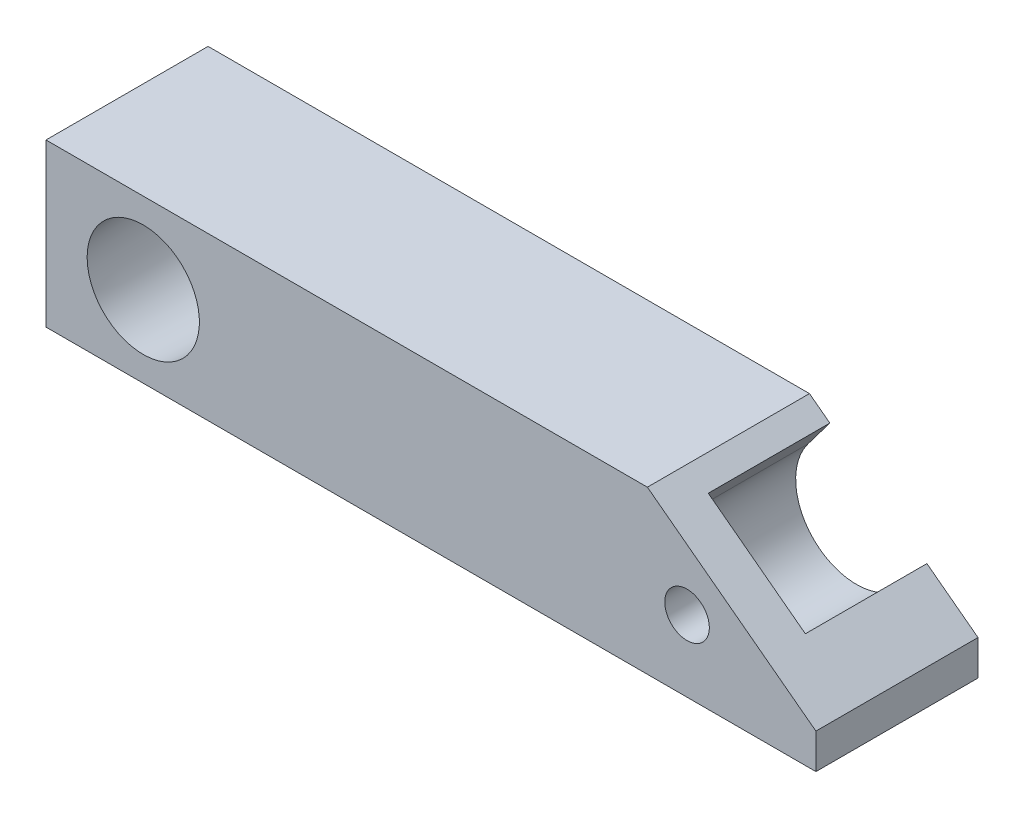
ISO-10303-21;
HEADER;
FILE_DESCRIPTION(('STEP AP214'),'2;1');
FILE_NAME('part.step','',(''),(''),'','','');
FILE_SCHEMA(('AUTOMOTIVE_DESIGN { 1 0 10303 214 1 1 1 1 }'));
ENDSEC;
DATA;
#1=APPLICATION_CONTEXT('core data for automotive mechanical design processes');
#2=APPLICATION_PROTOCOL_DEFINITION('international standard','automotive_design',2000,#1);
#3=PRODUCT_CONTEXT('',#1,'mechanical');
#4=PRODUCT('Part','Part','',(#3));
#5=PRODUCT_RELATED_PRODUCT_CATEGORY('part','',(#4));
#6=PRODUCT_DEFINITION_FORMATION('','',#4);
#7=PRODUCT_DEFINITION_CONTEXT('part definition',#1,'design');
#8=PRODUCT_DEFINITION('design','',#6,#7);
#9=PRODUCT_DEFINITION_SHAPE('','',#8);
#10=(LENGTH_UNIT() NAMED_UNIT(*) SI_UNIT(.MILLI.,.METRE.));
#11=(NAMED_UNIT(*) PLANE_ANGLE_UNIT() SI_UNIT($,.RADIAN.));
#12=(NAMED_UNIT(*) SI_UNIT($,.STERADIAN.) SOLID_ANGLE_UNIT());
#13=UNCERTAINTY_MEASURE_WITH_UNIT(LENGTH_MEASURE(1.E-05),#10,'distance_accuracy_value','');
#14=(GEOMETRIC_REPRESENTATION_CONTEXT(3) GLOBAL_UNCERTAINTY_ASSIGNED_CONTEXT((#13)) GLOBAL_UNIT_ASSIGNED_CONTEXT((#10,
#11,#12)) REPRESENTATION_CONTEXT('',''));
#15=CARTESIAN_POINT('',(0.,0.,0.));
#16=DIRECTION('',(0.,0.,1.));
#17=DIRECTION('',(1.,0.,0.));
#18=AXIS2_PLACEMENT_3D('',#15,#16,#17);
#19=CARTESIAN_POINT('',(-12.,-10.,-20.));
#20=DIRECTION('',(0.,0.,-1.));
#21=DIRECTION('',(0.,-1.,0.));
#22=AXIS2_PLACEMENT_3D('',#19,#20,#21);
#23=PLANE('',#22);
#24=CARTESIAN_POINT('',(0.,0.,-20.));
#25=DIRECTION('',(0.,0.,-1.));
#26=DIRECTION('',(-1.,0.,0.));
#27=AXIS2_PLACEMENT_3D('',#24,#25,#26);
#28=CIRCLE('',#27,7.925);
#29=CARTESIAN_POINT('',(-7.925,0.,-20.));
#30=VERTEX_POINT('',#29);
#31=EDGE_CURVE('E169',#30,#30,#28,.T.);
#32=ORIENTED_EDGE('',*,*,#31,.F.);
#33=EDGE_LOOP('',(#32));
#34=FACE_BOUND('',#33,.T.);
#35=CARTESIAN_POINT('',(68.,0.,-20.));
#36=DIRECTION('',(0.,0.,-1.));
#37=DIRECTION('',(-1.,0.,0.));
#38=AXIS2_PLACEMENT_3D('',#35,#36,#37);
#39=CIRCLE('',#38,7.5);
#40=CARTESIAN_POINT('',(73.9897663253547,-4.51361267364033,-20.));
#41=VERTEX_POINT('',#40);
#42=CARTESIAN_POINT('',(62.0102336746453,4.51361267364033,-20.));
#43=VERTEX_POINT('',#42);
#44=EDGE_CURVE('E138',#41,#43,#39,.T.);
#45=ORIENTED_EDGE('',*,*,#44,.F.);
#46=DIRECTION('',(0.601815023152043,0.798635510047297,0.));
#47=VECTOR('',#46,1.);
#48=CARTESIAN_POINT('',(73.9897663253547,-4.51361267364033,-20.));
#49=LINE('',#48,#47);
#50=CARTESIAN_POINT('',(76.6979339295389,-0.919752878427501,-20.));
#51=VERTEX_POINT('',#50);
#52=EDGE_CURVE('E199',#41,#51,#49,.T.);
#53=ORIENTED_EDGE('',*,*,#52,.T.);
#54=DIRECTION('',(-0.798635510047296,0.601815023152043,0.));
#55=VECTOR('',#54,1.);
#56=CARTESIAN_POINT('',(83.,-5.6687002898388,-20.));
#57=LINE('',#56,#55);
#58=CARTESIAN_POINT('',(83.,-5.6687002898388,-20.));
#59=VERTEX_POINT('',#58);
#60=EDGE_CURVE('E141',#59,#51,#57,.T.);
#61=ORIENTED_EDGE('',*,*,#60,.F.);
#62=DIRECTION('',(0.,-1.,0.));
#63=VECTOR('',#62,1.);
#64=CARTESIAN_POINT('',(83.,10.,-20.));
#65=LINE('',#64,#63);
#66=CARTESIAN_POINT('',(83.,-10.,-20.));
#67=VERTEX_POINT('',#66);
#68=EDGE_CURVE('E170',#59,#67,#65,.T.);
#69=ORIENTED_EDGE('',*,*,#68,.T.);
#70=DIRECTION('',(-1.,0.,0.));
#71=VECTOR('',#70,1.);
#72=CARTESIAN_POINT('',(83.,-10.,-20.));
#73=LINE('',#72,#71);
#74=CARTESIAN_POINT('',(-12.,-10.,-20.));
#75=VERTEX_POINT('',#74);
#76=EDGE_CURVE('E156',#67,#75,#73,.T.);
#77=ORIENTED_EDGE('',*,*,#76,.T.);
#78=DIRECTION('',(0.,1.,0.));
#79=VECTOR('',#78,1.);
#80=CARTESIAN_POINT('',(-12.,-10.,-20.));
#81=LINE('',#80,#79);
#82=CARTESIAN_POINT('',(-12.,10.,-20.));
#83=VERTEX_POINT('',#82);
#84=EDGE_CURVE('E175',#75,#83,#81,.T.);
#85=ORIENTED_EDGE('',*,*,#84,.T.);
#86=DIRECTION('',(1.,0.,0.));
#87=VECTOR('',#86,1.);
#88=CARTESIAN_POINT('',(-12.,10.,-20.));
#89=LINE('',#88,#87);
#90=CARTESIAN_POINT('',(62.2069324188469,10.,-20.));
#91=VERTEX_POINT('',#90);
#92=EDGE_CURVE('E171',#83,#91,#89,.T.);
#93=ORIENTED_EDGE('',*,*,#92,.T.);
#94=CARTESIAN_POINT('',(64.7184012788295,8.10747246885315,-20.));
#95=VERTEX_POINT('',#94);
#96=EDGE_CURVE('E142',#95,#91,#57,.T.);
#97=ORIENTED_EDGE('',*,*,#96,.F.);
#98=DIRECTION('',(0.601815023152043,0.798635510047296,0.));
#99=VECTOR('',#98,1.);
#100=CARTESIAN_POINT('',(62.0102336746453,4.51361267364033,-20.));
#101=LINE('',#100,#99);
#102=EDGE_CURVE('E202',#43,#95,#101,.T.);
#103=ORIENTED_EDGE('',*,*,#102,.F.);
#104=EDGE_LOOP('',(#45,#53,#61,#69,#77,#85,#93,#97,#103));
#105=FACE_BOUND('',#104,.T.);
#106=ADVANCED_FACE('F46',(#34,#105),#23,.T.);
#107=CARTESIAN_POINT('',(83.,-5.6687002898388,0.));
#108=DIRECTION('',(-0.601815023152043,-0.798635510047296,0.));
#109=DIRECTION('',(0.798635510047297,-0.601815023152044,0.));
#110=AXIS2_PLACEMENT_3D('',#107,#108,#109);
#111=PLANE('',#110);
#112=DIRECTION('',(0.,0.,-1.));
#113=VECTOR('',#112,1.);
#114=CARTESIAN_POINT('',(76.6979339295389,-0.919752878427501,-5.));
#115=LINE('',#114,#113);
#116=CARTESIAN_POINT('',(76.6979339295389,-0.919752878427501,-5.));
#117=VERTEX_POINT('',#116);
#118=EDGE_CURVE('E135',#117,#51,#115,.T.);
#119=ORIENTED_EDGE('',*,*,#118,.F.);
#120=DIRECTION('',(-0.798635510047296,0.601815023152043,0.));
#121=VECTOR('',#120,1.);
#122=CARTESIAN_POINT('',(76.6979339295389,-0.919752878427501,-5.));
#123=LINE('',#122,#121);
#124=CARTESIAN_POINT('',(64.7184012788295,8.10747246885315,-5.));
#125=VERTEX_POINT('',#124);
#126=EDGE_CURVE('E124',#117,#125,#123,.T.);
#127=ORIENTED_EDGE('',*,*,#126,.T.);
#128=DIRECTION('',(0.,0.,-1.));
#129=VECTOR('',#128,1.);
#130=CARTESIAN_POINT('',(64.7184012788295,8.10747246885315,-5.));
#131=LINE('',#130,#129);
#132=EDGE_CURVE('E143',#125,#95,#131,.T.);
#133=ORIENTED_EDGE('',*,*,#132,.T.);
#134=ORIENTED_EDGE('',*,*,#96,.T.);
#135=DIRECTION('',(0.,0.,-1.));
#136=VECTOR('',#135,1.);
#137=CARTESIAN_POINT('',(62.2069324188469,10.,0.));
#138=LINE('',#137,#136);
#139=CARTESIAN_POINT('',(62.2069324188469,10.,0.));
#140=VERTEX_POINT('',#139);
#141=EDGE_CURVE('E153',#140,#91,#138,.T.);
#142=ORIENTED_EDGE('',*,*,#141,.F.);
#143=DIRECTION('',(-0.798635510047296,0.601815023152043,0.));
#144=VECTOR('',#143,1.);
#145=CARTESIAN_POINT('',(83.,-5.6687002898388,0.));
#146=LINE('',#145,#144);
#147=CARTESIAN_POINT('',(83.,-5.6687002898388,0.));
#148=VERTEX_POINT('',#147);
#149=EDGE_CURVE('E150',#148,#140,#146,.T.);
#150=ORIENTED_EDGE('',*,*,#149,.F.);
#151=DIRECTION('',(0.,0.,-1.));
#152=VECTOR('',#151,1.);
#153=CARTESIAN_POINT('',(83.,-5.6687002898388,0.));
#154=LINE('',#153,#152);
#155=EDGE_CURVE('E70',#148,#59,#154,.T.);
#156=ORIENTED_EDGE('',*,*,#155,.T.);
#157=ORIENTED_EDGE('',*,*,#60,.T.);
#158=EDGE_LOOP('',(#119,#127,#133,#134,#142,#150,#156,#157));
#159=FACE_BOUND('',#158,.T.);
#160=ADVANCED_FACE('F140',(#159),#111,.F.);
#161=CARTESIAN_POINT('',(0.,0.,0.));
#162=DIRECTION('',(0.,0.,-1.));
#163=DIRECTION('',(-1.,0.,0.));
#164=AXIS2_PLACEMENT_3D('',#161,#162,#163);
#165=CONICAL_SURFACE('',#164,6.92584167948768,0.0499164165500011);
#166=CARTESIAN_POINT('',(0.,0.,0.));
#167=DIRECTION('',(0.,0.,-1.));
#168=DIRECTION('',(-1.,0.,0.));
#169=AXIS2_PLACEMENT_3D('',#166,#167,#168);
#170=CIRCLE('',#169,6.92584167948768);
#171=CARTESIAN_POINT('',(-6.92584167948768,0.,0.));
#172=VERTEX_POINT('',#171);
#173=EDGE_CURVE('E158',#172,#172,#170,.T.);
#174=ORIENTED_EDGE('',*,*,#173,.F.);
#175=EDGE_LOOP('',(#174));
#176=FACE_BOUND('',#175,.T.);
#177=ORIENTED_EDGE('',*,*,#31,.T.);
#178=EDGE_LOOP('',(#177));
#179=FACE_BOUND('',#178,.T.);
#180=ADVANCED_FACE('F238',(#176,#179),#165,.F.);
#181=CARTESIAN_POINT('',(83.,10.,-20.));
#182=DIRECTION('',(-1.,0.,0.));
#183=DIRECTION('',(0.,0.,1.));
#184=AXIS2_PLACEMENT_3D('',#181,#182,#183);
#185=PLANE('',#184);
#186=ORIENTED_EDGE('',*,*,#68,.F.);
#187=ORIENTED_EDGE('',*,*,#155,.F.);
#188=DIRECTION('',(0.,-1.,0.));
#189=VECTOR('',#188,1.);
#190=CARTESIAN_POINT('',(83.,10.,0.));
#191=LINE('',#190,#189);
#192=CARTESIAN_POINT('',(83.,-10.,0.));
#193=VERTEX_POINT('',#192);
#194=EDGE_CURVE('E168',#148,#193,#191,.T.);
#195=ORIENTED_EDGE('',*,*,#194,.T.);
#196=DIRECTION('',(0.,0.,1.));
#197=VECTOR('',#196,1.);
#198=CARTESIAN_POINT('',(83.,-10.,-20.));
#199=LINE('',#198,#197);
#200=EDGE_CURVE('E54',#67,#193,#199,.T.);
#201=ORIENTED_EDGE('',*,*,#200,.F.);
#202=EDGE_LOOP('',(#186,#187,#195,#201));
#203=FACE_BOUND('',#202,.T.);
#204=ADVANCED_FACE('F195',(#203),#185,.F.);
#205=CARTESIAN_POINT('',(-12.,10.,-20.));
#206=DIRECTION('',(0.,-1.,0.));
#207=DIRECTION('',(0.,0.,-1.));
#208=AXIS2_PLACEMENT_3D('',#205,#206,#207);
#209=PLANE('',#208);
#210=DIRECTION('',(1.,0.,0.));
#211=VECTOR('',#210,1.);
#212=CARTESIAN_POINT('',(-12.,10.,0.));
#213=LINE('',#212,#211);
#214=CARTESIAN_POINT('',(-12.,10.,0.));
#215=VERTEX_POINT('',#214);
#216=EDGE_CURVE('E49',#215,#140,#213,.T.);
#217=ORIENTED_EDGE('',*,*,#216,.T.);
#218=ORIENTED_EDGE('',*,*,#141,.T.);
#219=ORIENTED_EDGE('',*,*,#92,.F.);
#220=DIRECTION('',(0.,0.,1.));
#221=VECTOR('',#220,1.);
#222=CARTESIAN_POINT('',(-12.,10.,-20.));
#223=LINE('',#222,#221);
#224=EDGE_CURVE('E11',#83,#215,#223,.T.);
#225=ORIENTED_EDGE('',*,*,#224,.T.);
#226=EDGE_LOOP('',(#217,#218,#219,#225));
#227=FACE_BOUND('',#226,.T.);
#228=ADVANCED_FACE('F188',(#227),#209,.F.);
#229=CARTESIAN_POINT('',(-12.,-10.,-20.));
#230=DIRECTION('',(1.,0.,0.));
#231=DIRECTION('',(0.,1.,0.));
#232=AXIS2_PLACEMENT_3D('',#229,#230,#231);
#233=PLANE('',#232);
#234=DIRECTION('',(0.,1.,0.));
#235=VECTOR('',#234,1.);
#236=CARTESIAN_POINT('',(-12.,-10.,0.));
#237=LINE('',#236,#235);
#238=CARTESIAN_POINT('',(-12.,-10.,0.));
#239=VERTEX_POINT('',#238);
#240=EDGE_CURVE('E161',#239,#215,#237,.T.);
#241=ORIENTED_EDGE('',*,*,#240,.T.);
#242=ORIENTED_EDGE('',*,*,#224,.F.);
#243=ORIENTED_EDGE('',*,*,#84,.F.);
#244=DIRECTION('',(0.,0.,1.));
#245=VECTOR('',#244,1.);
#246=CARTESIAN_POINT('',(-12.,-10.,-20.));
#247=LINE('',#246,#245);
#248=EDGE_CURVE('E160',#75,#239,#247,.T.);
#249=ORIENTED_EDGE('',*,*,#248,.T.);
#250=EDGE_LOOP('',(#241,#242,#243,#249));
#251=FACE_BOUND('',#250,.T.);
#252=ADVANCED_FACE('F221',(#251),#233,.F.);
#253=CARTESIAN_POINT('',(83.,-10.,-20.));
#254=DIRECTION('',(0.,1.,0.));
#255=DIRECTION('',(1.,0.,0.));
#256=AXIS2_PLACEMENT_3D('',#253,#254,#255);
#257=PLANE('',#256);
#258=DIRECTION('',(-1.,0.,0.));
#259=VECTOR('',#258,1.);
#260=CARTESIAN_POINT('',(83.,-10.,0.));
#261=LINE('',#260,#259);
#262=EDGE_CURVE('E165',#193,#239,#261,.T.);
#263=ORIENTED_EDGE('',*,*,#262,.T.);
#264=ORIENTED_EDGE('',*,*,#248,.F.);
#265=ORIENTED_EDGE('',*,*,#76,.F.);
#266=ORIENTED_EDGE('',*,*,#200,.T.);
#267=EDGE_LOOP('',(#263,#264,#265,#266));
#268=FACE_BOUND('',#267,.T.);
#269=ADVANCED_FACE('F223',(#268),#257,.F.);
#270=CARTESIAN_POINT('',(-12.,-10.,0.));
#271=DIRECTION('',(0.,0.,-1.));
#272=DIRECTION('',(0.,-1.,0.));
#273=AXIS2_PLACEMENT_3D('',#270,#271,#272);
#274=PLANE('',#273);
#275=CARTESIAN_POINT('',(67.0972774652719,-1.19795326507094,0.));
#276=DIRECTION('',(0.,0.,-1.));
#277=DIRECTION('',(-1.,0.,0.));
#278=AXIS2_PLACEMENT_3D('',#275,#276,#277);
#279=CIRCLE('',#278,2.75000000000001);
#280=CARTESIAN_POINT('',(64.3472774652719,-1.19795326507094,0.));
#281=VERTEX_POINT('',#280);
#282=EDGE_CURVE('E203',#281,#281,#279,.T.);
#283=ORIENTED_EDGE('',*,*,#282,.T.);
#284=EDGE_LOOP('',(#283));
#285=FACE_BOUND('',#284,.T.);
#286=ORIENTED_EDGE('',*,*,#173,.T.);
#287=EDGE_LOOP('',(#286));
#288=FACE_BOUND('',#287,.T.);
#289=ORIENTED_EDGE('',*,*,#194,.F.);
#290=ORIENTED_EDGE('',*,*,#149,.T.);
#291=ORIENTED_EDGE('',*,*,#216,.F.);
#292=ORIENTED_EDGE('',*,*,#240,.F.);
#293=ORIENTED_EDGE('',*,*,#262,.F.);
#294=EDGE_LOOP('',(#289,#290,#291,#292,#293));
#295=FACE_BOUND('',#294,.T.);
#296=ADVANCED_FACE('F192',(#285,#288,#295),#274,.F.);
#297=CARTESIAN_POINT('',(73.9897663253547,-4.51361267364033,-5.));
#298=DIRECTION('',(-0.798635510047297,0.601815023152043,0.));
#299=DIRECTION('',(-0.601815023152043,-0.798635510047297,0.));
#300=AXIS2_PLACEMENT_3D('',#297,#298,#299);
#301=PLANE('',#300);
#302=ORIENTED_EDGE('',*,*,#52,.F.);
#303=DIRECTION('',(0.,0.,-1.));
#304=VECTOR('',#303,1.);
#305=CARTESIAN_POINT('',(73.9897663253547,-4.51361267364033,-5.));
#306=LINE('',#305,#304);
#307=CARTESIAN_POINT('',(73.9897663253547,-4.51361267364033,-5.));
#308=VERTEX_POINT('',#307);
#309=EDGE_CURVE('E137',#308,#41,#306,.T.);
#310=ORIENTED_EDGE('',*,*,#309,.F.);
#311=DIRECTION('',(0.601815023152043,0.798635510047297,0.));
#312=VECTOR('',#311,1.);
#313=CARTESIAN_POINT('',(73.9897663253547,-4.51361267364033,-5.));
#314=LINE('',#313,#312);
#315=EDGE_CURVE('E127',#308,#117,#314,.T.);
#316=ORIENTED_EDGE('',*,*,#315,.T.);
#317=ORIENTED_EDGE('',*,*,#118,.T.);
#318=EDGE_LOOP('',(#302,#310,#316,#317));
#319=FACE_BOUND('',#318,.T.);
#320=ADVANCED_FACE('F134',(#319),#301,.T.);
#321=CARTESIAN_POINT('',(62.0102336746453,4.51361267364033,-5.));
#322=DIRECTION('',(-0.798635510047296,0.601815023152043,0.));
#323=DIRECTION('',(-0.601815023152043,-0.798635510047296,0.));
#324=AXIS2_PLACEMENT_3D('',#321,#322,#323);
#325=PLANE('',#324);
#326=ORIENTED_EDGE('',*,*,#102,.T.);
#327=ORIENTED_EDGE('',*,*,#132,.F.);
#328=DIRECTION('',(0.601815023152043,0.798635510047296,0.));
#329=VECTOR('',#328,1.);
#330=CARTESIAN_POINT('',(62.0102336746453,4.51361267364033,-5.));
#331=LINE('',#330,#329);
#332=CARTESIAN_POINT('',(62.0102336746453,4.51361267364033,-5.));
#333=VERTEX_POINT('',#332);
#334=EDGE_CURVE('E62',#333,#125,#331,.T.);
#335=ORIENTED_EDGE('',*,*,#334,.F.);
#336=DIRECTION('',(0.,0.,-1.));
#337=VECTOR('',#336,1.);
#338=CARTESIAN_POINT('',(62.0102336746453,4.51361267364033,-5.));
#339=LINE('',#338,#337);
#340=EDGE_CURVE('E146',#333,#43,#339,.T.);
#341=ORIENTED_EDGE('',*,*,#340,.T.);
#342=EDGE_LOOP('',(#326,#327,#335,#341));
#343=FACE_BOUND('',#342,.T.);
#344=ADVANCED_FACE('F215',(#343),#325,.F.);
#345=CARTESIAN_POINT('',(68.,0.,-5.));
#346=DIRECTION('',(0.,0.,-1.));
#347=DIRECTION('',(-1.,0.,0.));
#348=AXIS2_PLACEMENT_3D('',#345,#346,#347);
#349=CYLINDRICAL_SURFACE('',#348,7.5);
#350=ORIENTED_EDGE('',*,*,#44,.T.);
#351=ORIENTED_EDGE('',*,*,#340,.F.);
#352=CARTESIAN_POINT('',(68.,0.,-5.));
#353=DIRECTION('',(0.,0.,-1.));
#354=DIRECTION('',(-1.,0.,0.));
#355=AXIS2_PLACEMENT_3D('',#352,#353,#354);
#356=CIRCLE('',#355,7.5);
#357=EDGE_CURVE('E210',#308,#333,#356,.T.);
#358=ORIENTED_EDGE('',*,*,#357,.F.);
#359=ORIENTED_EDGE('',*,*,#309,.T.);
#360=EDGE_LOOP('',(#350,#351,#358,#359));
#361=FACE_BOUND('',#360,.T.);
#362=ADVANCED_FACE('F217',(#361),#349,.F.);
#363=CARTESIAN_POINT('',(68.,0.,-5.));
#364=DIRECTION('',(0.,0.,-1.));
#365=DIRECTION('',(-1.,0.,0.));
#366=AXIS2_PLACEMENT_3D('',#363,#364,#365);
#367=PLANE('',#366);
#368=CARTESIAN_POINT('',(67.0972774652719,-1.19795326507094,-5.));
#369=DIRECTION('',(0.,0.,-1.));
#370=DIRECTION('',(-1.,0.,0.));
#371=AXIS2_PLACEMENT_3D('',#368,#369,#370);
#372=CIRCLE('',#371,2.75000000000001);
#373=CARTESIAN_POINT('',(64.3472774652719,-1.19795326507094,-5.));
#374=VERTEX_POINT('',#373);
#375=EDGE_CURVE('E207',#374,#374,#372,.T.);
#376=ORIENTED_EDGE('',*,*,#375,.F.);
#377=EDGE_LOOP('',(#376));
#378=FACE_BOUND('',#377,.T.);
#379=ORIENTED_EDGE('',*,*,#315,.F.);
#380=ORIENTED_EDGE('',*,*,#357,.T.);
#381=ORIENTED_EDGE('',*,*,#334,.T.);
#382=ORIENTED_EDGE('',*,*,#126,.F.);
#383=EDGE_LOOP('',(#379,#380,#381,#382));
#384=FACE_BOUND('',#383,.T.);
#385=ADVANCED_FACE('F126',(#378,#384),#367,.T.);
#386=CARTESIAN_POINT('',(67.0972774652719,-1.19795326507094,10.));
#387=DIRECTION('',(0.,0.,-1.));
#388=DIRECTION('',(-1.,0.,0.));
#389=AXIS2_PLACEMENT_3D('',#386,#387,#388);
#390=CYLINDRICAL_SURFACE('',#389,2.75000000000001);
#391=ORIENTED_EDGE('',*,*,#375,.T.);
#392=EDGE_LOOP('',(#391));
#393=FACE_BOUND('',#392,.T.);
#394=ORIENTED_EDGE('',*,*,#282,.F.);
#395=EDGE_LOOP('',(#394));
#396=FACE_BOUND('',#395,.T.);
#397=ADVANCED_FACE('F263',(#393,#396),#390,.F.);
#398=CLOSED_SHELL('',(#106,#160,#180,#204,#228,#252,#269,#296,#320,#344,#362,#385,#397));
#399=MANIFOLD_SOLID_BREP('B2',#398);
#400=ADVANCED_BREP_SHAPE_REPRESENTATION('',(#18,#399),#14);
#401=SHAPE_DEFINITION_REPRESENTATION(#9,#400);
ENDSEC;
END-ISO-10303-21;
